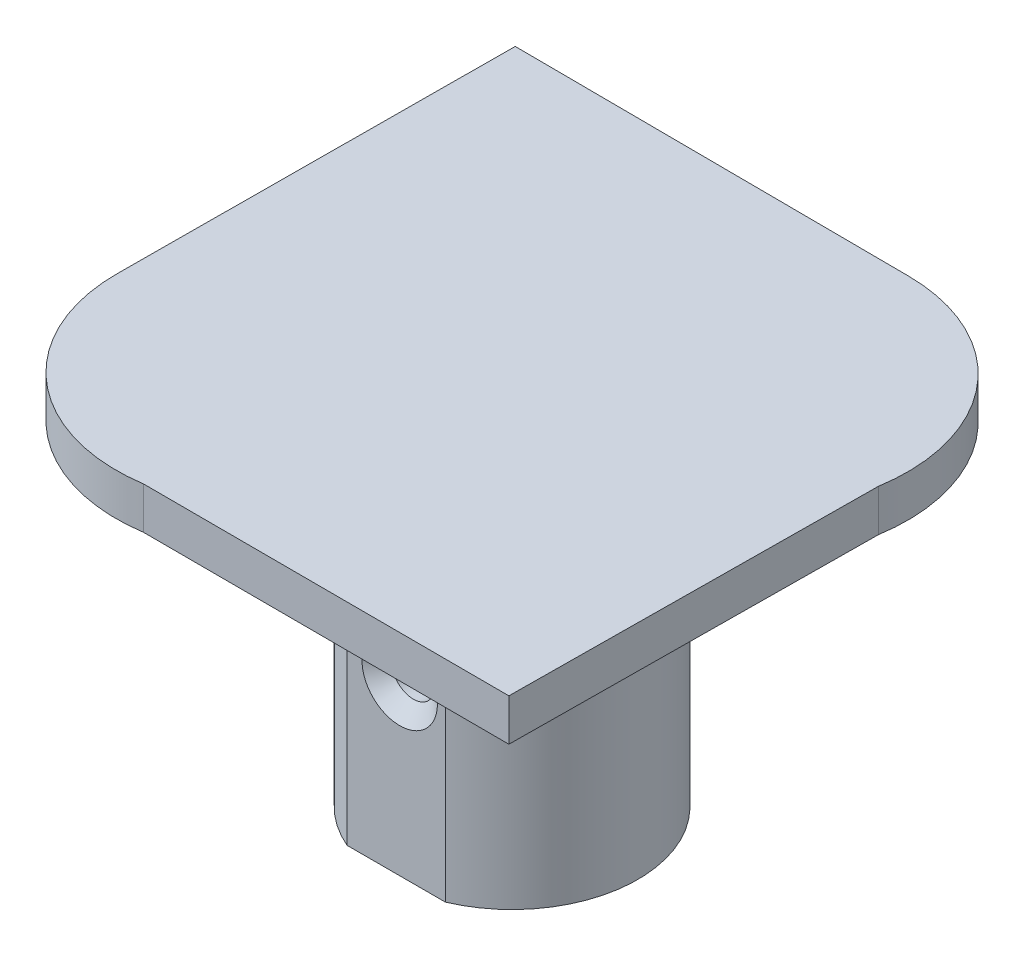
ISO-10303-21;
HEADER;
FILE_DESCRIPTION(('STEP AP214'),'2;1');
FILE_NAME('part.step','',(''),(''),'','','');
FILE_SCHEMA(('AUTOMOTIVE_DESIGN { 1 0 10303 214 1 1 1 1 }'));
ENDSEC;
DATA;
#1=APPLICATION_CONTEXT('core data for automotive mechanical design processes');
#2=APPLICATION_PROTOCOL_DEFINITION('international standard','automotive_design',2000,#1);
#3=PRODUCT_CONTEXT('',#1,'mechanical');
#4=PRODUCT('Part','Part','',(#3));
#5=PRODUCT_RELATED_PRODUCT_CATEGORY('part','',(#4));
#6=PRODUCT_DEFINITION_FORMATION('','',#4);
#7=PRODUCT_DEFINITION_CONTEXT('part definition',#1,'design');
#8=PRODUCT_DEFINITION('design','',#6,#7);
#9=PRODUCT_DEFINITION_SHAPE('','',#8);
#10=(LENGTH_UNIT() NAMED_UNIT(*) SI_UNIT(.MILLI.,.METRE.));
#11=(NAMED_UNIT(*) PLANE_ANGLE_UNIT() SI_UNIT($,.RADIAN.));
#12=(NAMED_UNIT(*) SI_UNIT($,.STERADIAN.) SOLID_ANGLE_UNIT());
#13=UNCERTAINTY_MEASURE_WITH_UNIT(LENGTH_MEASURE(1.E-05),#10,'distance_accuracy_value','');
#14=(GEOMETRIC_REPRESENTATION_CONTEXT(3) GLOBAL_UNCERTAINTY_ASSIGNED_CONTEXT((#13)) GLOBAL_UNIT_ASSIGNED_CONTEXT((#10,
#11,#12)) REPRESENTATION_CONTEXT('',''));
#15=CARTESIAN_POINT('',(0.,0.,0.));
#16=DIRECTION('',(0.,0.,1.));
#17=DIRECTION('',(1.,0.,0.));
#18=AXIS2_PLACEMENT_3D('',#15,#16,#17);
#19=CARTESIAN_POINT('',(-14.787057316952,3.175,-0.0839624008313394));
#20=DIRECTION('',(-0.999983879975885,0.,-0.00567800919112956));
#21=DIRECTION('',(-0.00567800919112956,0.,0.999983879975885));
#22=AXIS2_PLACEMENT_3D('',#19,#20,#21);
#23=PLANE('',#22);
#24=DIRECTION('',(0.00567800919112956,0.,-0.999983879975885));
#25=VECTOR('',#24,1.);
#26=CARTESIAN_POINT('',(-14.787057316952,0.,-0.0839624008313394));
#27=LINE('',#26,#25);
#28=CARTESIAN_POINT('',(-14.7878214169935,0.,0.0506072517345835));
#29=VERTEX_POINT('',#28);
#30=CARTESIAN_POINT('',(-14.6178057651198,0.,-29.8917379425649));
#31=VERTEX_POINT('',#30);
#32=EDGE_CURVE('E235',#29,#31,#27,.T.);
#33=ORIENTED_EDGE('',*,*,#32,.F.);
#34=DIRECTION('',(0.,-1.,0.));
#35=VECTOR('',#34,1.);
#36=CARTESIAN_POINT('',(-14.7878214169935,3.175,0.0506072517345835));
#37=LINE('',#36,#35);
#38=CARTESIAN_POINT('',(-14.7878214169935,3.175,0.0506072517345835));
#39=VERTEX_POINT('',#38);
#40=EDGE_CURVE('E241',#39,#29,#37,.T.);
#41=ORIENTED_EDGE('',*,*,#40,.F.);
#42=DIRECTION('',(0.00567800919112956,0.,-0.999983879975885));
#43=VECTOR('',#42,1.);
#44=CARTESIAN_POINT('',(-14.787057316952,3.175,-0.0839624008313394));
#45=LINE('',#44,#43);
#46=CARTESIAN_POINT('',(-14.6178057651198,3.175,-29.8917379425649));
#47=VERTEX_POINT('',#46);
#48=EDGE_CURVE('E218',#39,#47,#45,.T.);
#49=ORIENTED_EDGE('',*,*,#48,.T.);
#50=DIRECTION('',(0.,-1.,0.));
#51=VECTOR('',#50,1.);
#52=CARTESIAN_POINT('',(-14.6178057651198,3.175,-29.8917379425649));
#53=LINE('',#52,#51);
#54=EDGE_CURVE('E243',#47,#31,#53,.T.);
#55=ORIENTED_EDGE('',*,*,#54,.T.);
#56=EDGE_LOOP('',(#33,#41,#49,#55));
#57=FACE_BOUND('',#56,.T.);
#58=ADVANCED_FACE('F73',(#57),#23,.T.);
#59=CARTESIAN_POINT('',(0.,0.,0.));
#60=DIRECTION('',(0.,1.,0.));
#61=DIRECTION('',(0.,0.,1.));
#62=AXIS2_PLACEMENT_3D('',#59,#60,#61);
#63=PLANE('',#62);
#64=CARTESIAN_POINT('',(6.55275451155434,0.,-8.47938761040723));
#65=DIRECTION('',(0.,1.,0.));
#66=DIRECTION('',(0.,0.,1.));
#67=AXIS2_PLACEMENT_3D('',#64,#65,#66);
#68=CIRCLE('',#67,14.525);
#69=CARTESIAN_POINT('',(-5.02592046515915,0.,-17.2492171859251));
#70=VERTEX_POINT('',#69);
#71=CARTESIAN_POINT('',(-5.02592046515915,0.,0.290441965110683));
#72=VERTEX_POINT('',#71);
#73=EDGE_CURVE('E257',#70,#72,#68,.T.);
#74=ORIENTED_EDGE('',*,*,#73,.T.);
#75=DIRECTION('',(1.,0.,0.));
#76=VECTOR('',#75,1.);
#77=CARTESIAN_POINT('',(2.83580492669698,0.,0.290441965110683));
#78=LINE('',#77,#76);
#79=CARTESIAN_POINT('',(18.1314294882678,0.,0.290441965110683));
#80=VERTEX_POINT('',#79);
#81=EDGE_CURVE('E193',#72,#80,#78,.T.);
#82=ORIENTED_EDGE('',*,*,#81,.T.);
#83=CARTESIAN_POINT('',(6.55275451155434,0.,-8.47938761040723));
#84=DIRECTION('',(0.,1.,0.));
#85=DIRECTION('',(0.,0.,1.));
#86=AXIS2_PLACEMENT_3D('',#83,#84,#85);
#87=CIRCLE('',#86,14.525);
#88=CARTESIAN_POINT('',(18.1314294882678,0.,-17.2492171859251));
#89=VERTEX_POINT('',#88);
#90=EDGE_CURVE('E254',#80,#89,#87,.T.);
#91=ORIENTED_EDGE('',*,*,#90,.T.);
#92=DIRECTION('',(-1.,0.,0.));
#93=VECTOR('',#92,1.);
#94=CARTESIAN_POINT('',(2.83580492669698,0.,-17.2492171859251));
#95=LINE('',#94,#93);
#96=EDGE_CURVE('E191',#89,#70,#95,.T.);
#97=ORIENTED_EDGE('',*,*,#96,.T.);
#98=EDGE_LOOP('',(#74,#82,#91,#97));
#99=FACE_BOUND('',#98,.T.);
#100=DIRECTION('',(0.999997371152212,0.,0.0022929650381687));
#101=VECTOR('',#100,1.);
#102=CARTESIAN_POINT('',(-0.0295089928449218,0.,12.8693262998196));
#103=LINE('',#102,#101);
#104=CARTESIAN_POINT('',(1.55691431968918E-13,0.,12.8693939630863));
#105=VERTEX_POINT('',#104);
#106=CARTESIAN_POINT('',(27.7233147882286,0.,12.9329627217505));
#107=VERTEX_POINT('',#106);
#108=EDGE_CURVE('E203',#105,#107,#103,.T.);
#109=ORIENTED_EDGE('',*,*,#108,.F.);
#110=CARTESIAN_POINT('',(-1.91876519569873,0.,0.143843244123492));
#111=DIRECTION('',(0.,1.,0.));
#112=DIRECTION('',(0.,0.,1.));
#113=AXIS2_PLACEMENT_3D('',#110,#111,#112);
#114=CIRCLE('',#113,12.8693939630863);
#115=EDGE_CURVE('E210',#29,#105,#114,.T.);
#116=ORIENTED_EDGE('',*,*,#115,.F.);
#117=ORIENTED_EDGE('',*,*,#32,.T.);
#118=DIRECTION('',(-0.999983879975885,0.,-0.00567800919112986));
#119=VECTOR('',#118,1.);
#120=CARTESIAN_POINT('',(0.169251551832196,0.,-29.8077755417336));
#121=LINE('',#120,#119);
#122=CARTESIAN_POINT('',(15.3245394291797,0.,-29.7217222906913));
#123=VERTEX_POINT('',#122);
#124=EDGE_CURVE('E232',#123,#31,#121,.T.);
#125=ORIENTED_EDGE('',*,*,#124,.F.);
#126=CARTESIAN_POINT('',(15.2716305265402,0.,-16.8524370881192));
#127=DIRECTION('',(0.,1.,0.));
#128=DIRECTION('',(0.,0.,1.));
#129=AXIS2_PLACEMENT_3D('',#126,#127,#128);
#130=CIRCLE('',#129,12.8693939630863);
#131=CARTESIAN_POINT('',(27.974571525793,0.,-14.7892863552293));
#132=VERTEX_POINT('',#131);
#133=EDGE_CURVE('E229',#123,#132,#130,.F.);
#134=ORIENTED_EDGE('',*,*,#133,.T.);
#135=DIRECTION('',(-0.00906298828145228,0.,0.999958930278344));
#136=VECTOR('',#135,1.);
#137=CARTESIAN_POINT('',(27.8382441331033,0.,0.252308042575603));
#138=LINE('',#137,#136);
#139=EDGE_CURVE('E226',#132,#107,#138,.T.);
#140=ORIENTED_EDGE('',*,*,#139,.T.);
#141=EDGE_LOOP('',(#109,#116,#117,#125,#134,#140));
#142=FACE_BOUND('',#141,.T.);
#143=ADVANCED_FACE('F290',(#99,#142),#63,.F.);
#144=CARTESIAN_POINT('',(0.169251551832196,3.175,-29.8077755417336));
#145=DIRECTION('',(-0.00567800919112985,0.,0.999983879975885));
#146=DIRECTION('',(0.999983879975885,0.,0.00567800919112985));
#147=AXIS2_PLACEMENT_3D('',#144,#145,#146);
#148=PLANE('',#147);
#149=ORIENTED_EDGE('',*,*,#124,.T.);
#150=ORIENTED_EDGE('',*,*,#54,.F.);
#151=DIRECTION('',(-0.999983879975885,0.,-0.00567800919112986));
#152=VECTOR('',#151,1.);
#153=CARTESIAN_POINT('',(0.169251551832196,3.175,-29.8077755417336));
#154=LINE('',#153,#152);
#155=CARTESIAN_POINT('',(15.3245394291797,3.175,-29.7217222906913));
#156=VERTEX_POINT('',#155);
#157=EDGE_CURVE('E216',#156,#47,#154,.T.);
#158=ORIENTED_EDGE('',*,*,#157,.F.);
#159=DIRECTION('',(0.,-1.,0.));
#160=VECTOR('',#159,1.);
#161=CARTESIAN_POINT('',(15.3245394291797,3.175,-29.7217222906913));
#162=LINE('',#161,#160);
#163=EDGE_CURVE('E245',#156,#123,#162,.T.);
#164=ORIENTED_EDGE('',*,*,#163,.T.);
#165=EDGE_LOOP('',(#149,#150,#158,#164));
#166=FACE_BOUND('',#165,.T.);
#167=ADVANCED_FACE('F293',(#166),#148,.F.);
#168=CARTESIAN_POINT('',(15.2716305265402,3.175,-16.8524370881192));
#169=DIRECTION('',(0.,-1.,0.));
#170=DIRECTION('',(0.,0.,-1.));
#171=AXIS2_PLACEMENT_3D('',#168,#169,#170);
#172=CYLINDRICAL_SURFACE('',#171,12.8693939630863);
#173=ORIENTED_EDGE('',*,*,#133,.F.);
#174=ORIENTED_EDGE('',*,*,#163,.F.);
#175=CARTESIAN_POINT('',(15.2716305265402,3.175,-16.8524370881192));
#176=DIRECTION('',(0.,1.,0.));
#177=DIRECTION('',(0.,0.,1.));
#178=AXIS2_PLACEMENT_3D('',#175,#176,#177);
#179=CIRCLE('',#178,12.8693939630863);
#180=CARTESIAN_POINT('',(27.974571525793,3.175,-14.7892863552293));
#181=VERTEX_POINT('',#180);
#182=EDGE_CURVE('E213',#156,#181,#179,.F.);
#183=ORIENTED_EDGE('',*,*,#182,.T.);
#184=DIRECTION('',(0.,-1.,0.));
#185=VECTOR('',#184,1.);
#186=CARTESIAN_POINT('',(27.974571525793,3.175,-14.7892863552293));
#187=LINE('',#186,#185);
#188=EDGE_CURVE('E247',#181,#132,#187,.T.);
#189=ORIENTED_EDGE('',*,*,#188,.T.);
#190=EDGE_LOOP('',(#173,#174,#183,#189));
#191=FACE_BOUND('',#190,.T.);
#192=ADVANCED_FACE('F305',(#191),#172,.T.);
#193=CARTESIAN_POINT('',(27.8382441331033,3.175,0.252308042575603));
#194=DIRECTION('',(0.999958930278344,0.,0.00906298828145228));
#195=DIRECTION('',(0.00906298828145228,0.,-0.999958930278344));
#196=AXIS2_PLACEMENT_3D('',#193,#194,#195);
#197=PLANE('',#196);
#198=ORIENTED_EDGE('',*,*,#139,.F.);
#199=ORIENTED_EDGE('',*,*,#188,.F.);
#200=DIRECTION('',(-0.00906298828145228,0.,0.999958930278344));
#201=VECTOR('',#200,1.);
#202=CARTESIAN_POINT('',(27.8382441331033,3.175,0.252308042575603));
#203=LINE('',#202,#201);
#204=CARTESIAN_POINT('',(27.7233147882286,3.175,12.9329627217505));
#205=VERTEX_POINT('',#204);
#206=EDGE_CURVE('E209',#181,#205,#203,.T.);
#207=ORIENTED_EDGE('',*,*,#206,.T.);
#208=DIRECTION('',(0.,-1.,0.));
#209=VECTOR('',#208,1.);
#210=CARTESIAN_POINT('',(27.7233147882286,3.175,12.9329627217505));
#211=LINE('',#210,#209);
#212=EDGE_CURVE('E249',#205,#107,#211,.T.);
#213=ORIENTED_EDGE('',*,*,#212,.T.);
#214=EDGE_LOOP('',(#198,#199,#207,#213));
#215=FACE_BOUND('',#214,.T.);
#216=ADVANCED_FACE('F309',(#215),#197,.T.);
#217=CARTESIAN_POINT('',(-0.0295089928449218,3.175,12.8693262998196));
#218=DIRECTION('',(0.0022929650381687,0.,-0.999997371152211));
#219=DIRECTION('',(-0.999997371152212,0.,-0.0022929650381687));
#220=AXIS2_PLACEMENT_3D('',#217,#218,#219);
#221=PLANE('',#220);
#222=ORIENTED_EDGE('',*,*,#108,.T.);
#223=ORIENTED_EDGE('',*,*,#212,.F.);
#224=DIRECTION('',(0.999997371152212,0.,0.0022929650381687));
#225=VECTOR('',#224,1.);
#226=CARTESIAN_POINT('',(-0.0295089928449218,3.175,12.8693262998196));
#227=LINE('',#226,#225);
#228=CARTESIAN_POINT('',(1.55691431968918E-13,3.175,12.8693939630863));
#229=VERTEX_POINT('',#228);
#230=EDGE_CURVE('E207',#229,#205,#227,.T.);
#231=ORIENTED_EDGE('',*,*,#230,.F.);
#232=DIRECTION('',(0.,-1.,0.));
#233=VECTOR('',#232,1.);
#234=CARTESIAN_POINT('',(1.55691431968918E-13,3.175,12.8693939630863));
#235=LINE('',#234,#233);
#236=EDGE_CURVE('E223',#229,#105,#235,.T.);
#237=ORIENTED_EDGE('',*,*,#236,.T.);
#238=EDGE_LOOP('',(#222,#223,#231,#237));
#239=FACE_BOUND('',#238,.T.);
#240=ADVANCED_FACE('F298',(#239),#221,.F.);
#241=CARTESIAN_POINT('',(-1.91876519569873,3.175,0.143843244123492));
#242=DIRECTION('',(0.,-1.,0.));
#243=DIRECTION('',(0.,0.,-1.));
#244=AXIS2_PLACEMENT_3D('',#241,#242,#243);
#245=CYLINDRICAL_SURFACE('',#244,12.8693939630863);
#246=ORIENTED_EDGE('',*,*,#115,.T.);
#247=ORIENTED_EDGE('',*,*,#236,.F.);
#248=CARTESIAN_POINT('',(-1.91876519569873,3.175,0.143843244123492));
#249=DIRECTION('',(0.,1.,0.));
#250=DIRECTION('',(0.,0.,1.));
#251=AXIS2_PLACEMENT_3D('',#248,#249,#250);
#252=CIRCLE('',#251,12.8693939630863);
#253=EDGE_CURVE('E221',#39,#229,#252,.T.);
#254=ORIENTED_EDGE('',*,*,#253,.F.);
#255=ORIENTED_EDGE('',*,*,#40,.T.);
#256=EDGE_LOOP('',(#246,#247,#254,#255));
#257=FACE_BOUND('',#256,.T.);
#258=ADVANCED_FACE('F288',(#257),#245,.T.);
#259=CARTESIAN_POINT('',(0.,3.175,0.));
#260=DIRECTION('',(0.,1.,0.));
#261=DIRECTION('',(0.,0.,1.));
#262=AXIS2_PLACEMENT_3D('',#259,#260,#261);
#263=PLANE('',#262);
#264=ORIENTED_EDGE('',*,*,#230,.T.);
#265=ORIENTED_EDGE('',*,*,#206,.F.);
#266=ORIENTED_EDGE('',*,*,#182,.F.);
#267=ORIENTED_EDGE('',*,*,#157,.T.);
#268=ORIENTED_EDGE('',*,*,#48,.F.);
#269=ORIENTED_EDGE('',*,*,#253,.T.);
#270=EDGE_LOOP('',(#264,#265,#266,#267,#268,#269));
#271=FACE_BOUND('',#270,.T.);
#272=ADVANCED_FACE('F285',(#271),#263,.T.);
#273=CARTESIAN_POINT('',(6.55275451155434,-25.4,-8.47938761040723));
#274=DIRECTION('',(0.,1.,0.));
#275=DIRECTION('',(0.,0.,1.));
#276=AXIS2_PLACEMENT_3D('',#273,#274,#275);
#277=CYLINDRICAL_SURFACE('',#276,9.525);
#278=DIRECTION('',(0.,1.,0.));
#279=VECTOR('',#278,1.);
#280=CARTESIAN_POINT('',(2.83580492669698,-25.4,0.290441965110683));
#281=LINE('',#280,#279);
#282=CARTESIAN_POINT('',(2.83580492669698,-25.4,0.290441965110683));
#283=VERTEX_POINT('',#282);
#284=CARTESIAN_POINT('',(2.83580492669698,-5.,0.290441965110683));
#285=VERTEX_POINT('',#284);
#286=EDGE_CURVE('E166',#283,#285,#281,.T.);
#287=ORIENTED_EDGE('',*,*,#286,.T.);
#288=CARTESIAN_POINT('',(6.55275451155434,-5.,-8.47938761040723));
#289=DIRECTION('',(0.,1.,0.));
#290=DIRECTION('',(0.,0.,1.));
#291=AXIS2_PLACEMENT_3D('',#288,#289,#290);
#292=CIRCLE('',#291,9.525);
#293=CARTESIAN_POINT('',(2.83580492669698,-5.,-17.2492171859251));
#294=VERTEX_POINT('',#293);
#295=EDGE_CURVE('E260',#285,#294,#292,.F.);
#296=ORIENTED_EDGE('',*,*,#295,.T.);
#297=DIRECTION('',(0.,1.,0.));
#298=VECTOR('',#297,1.);
#299=CARTESIAN_POINT('',(2.83580492669698,-25.4,-17.2492171859251));
#300=LINE('',#299,#298);
#301=CARTESIAN_POINT('',(2.83580492669698,-25.4,-17.2492171859251));
#302=VERTEX_POINT('',#301);
#303=EDGE_CURVE('E190',#302,#294,#300,.T.);
#304=ORIENTED_EDGE('',*,*,#303,.F.);
#305=CARTESIAN_POINT('',(6.55275451155434,-25.4,-8.47938761040723));
#306=DIRECTION('',(0.,1.,0.));
#307=DIRECTION('',(0.,0.,1.));
#308=AXIS2_PLACEMENT_3D('',#305,#306,#307);
#309=CIRCLE('',#308,9.525);
#310=EDGE_CURVE('E183',#302,#283,#309,.T.);
#311=ORIENTED_EDGE('',*,*,#310,.T.);
#312=EDGE_LOOP('',(#287,#296,#304,#311));
#313=FACE_BOUND('',#312,.T.);
#314=ADVANCED_FACE('F188',(#313),#277,.T.);
#315=CARTESIAN_POINT('',(2.83580492669698,-25.4,-17.2492171859251));
#316=DIRECTION('',(0.,0.,-1.));
#317=DIRECTION('',(-1.,0.,0.));
#318=AXIS2_PLACEMENT_3D('',#315,#316,#317);
#319=PLANE('',#318);
#320=ORIENTED_EDGE('',*,*,#96,.F.);
#321=CARTESIAN_POINT('',(18.1314294882678,0.,-17.2492171859251));
#322=CARTESIAN_POINT('',(17.9194691926212,-1.08010335164074E-05,-17.2492171859251));
#323=CARTESIAN_POINT('',(17.7076646851101,-0.00856427086780167,-17.2492171859251));
#324=CARTESIAN_POINT('',(17.2854870599636,-0.041729824746225,-17.2492171859251));
#325=CARTESIAN_POINT('',(17.0751128730227,-0.0663281678904239,-17.2492171859251));
#326=CARTESIAN_POINT('',(16.4487753805645,-0.162445019380643,-17.2492171859251));
#327=CARTESIAN_POINT('',(16.0360587919172,-0.256300466560732,-17.2492171859251));
#328=CARTESIAN_POINT('',(15.3953364668106,-0.445870901359424,-17.2492171859251));
#329=CARTESIAN_POINT('',(15.1619967507449,-0.524528457185258,-17.2492171859251));
#330=CARTESIAN_POINT('',(14.7014847114515,-0.698203532807642,-17.2492171859251));
#331=CARTESIAN_POINT('',(14.4743111865138,-0.793217837998378,-17.2492171859251));
#332=CARTESIAN_POINT('',(14.0266364385629,-0.998718780997651,-17.2492171859251));
#333=CARTESIAN_POINT('',(13.8061473842654,-1.10923179134389,-17.2492171859251));
#334=CARTESIAN_POINT('',(13.3731625151585,-1.34487158663403,-17.2492171859251));
#335=CARTESIAN_POINT('',(13.1606648550108,-1.46999497007793,-17.2492171859251));
#336=CARTESIAN_POINT('',(12.8102233220454,-1.69303100460494,-17.2492171859251));
#337=CARTESIAN_POINT('',(12.6698410781402,-1.78713363775158,-17.2492171859251));
#338=CARTESIAN_POINT('',(12.3939547995107,-1.9822289869433,-17.2492171859251));
#339=CARTESIAN_POINT('',(12.2584501303572,-2.08322080192479,-17.2492171859251));
#340=CARTESIAN_POINT('',(11.9932620102002,-2.29231554978037,-17.2492171859251));
#341=CARTESIAN_POINT('',(11.8635725657559,-2.40041086421365,-17.2492171859251));
#342=CARTESIAN_POINT('',(11.6111248586294,-2.62440060019461,-17.2492171859251));
#343=CARTESIAN_POINT('',(11.4883640428069,-2.74029211394592,-17.2492171859251));
#344=CARTESIAN_POINT('',(11.2997524633104,-2.93212125346451,-17.2492171859251));
#345=CARTESIAN_POINT('',(11.231003184476,-3.00521308215662,-17.2492171859251));
#346=CARTESIAN_POINT('',(11.097328997464,-3.15480287485262,-17.2492171859251));
#347=CARTESIAN_POINT('',(11.0324031910437,-3.23130003137279,-17.2492171859251));
#348=CARTESIAN_POINT('',(10.9072360263084,-3.3880415076945,-17.2492171859251));
#349=CARTESIAN_POINT('',(10.8469938239118,-3.46828514811108,-17.2492171859251));
#350=CARTESIAN_POINT('',(10.7324131067761,-3.63285271555483,-17.2492171859251));
#351=CARTESIAN_POINT('',(10.6780720798972,-3.71717488407441,-17.2492171859251));
#352=CARTESIAN_POINT('',(10.5594784262292,-3.9199510979995,-17.2492171859251));
#353=CARTESIAN_POINT('',(10.4982120601026,-4.04019821891992,-17.2492171859251));
#354=CARTESIAN_POINT('',(10.3946399863679,-4.28830832952067,-17.2492171859251));
#355=CARTESIAN_POINT('',(10.35224954079,-4.41613430281332,-17.2492171859251));
#356=CARTESIAN_POINT('',(10.3050692840302,-4.62083288879181,-17.2492171859251));
#357=CARTESIAN_POINT('',(10.2919461376699,-4.69580215913049,-17.2492171859251));
#358=CARTESIAN_POINT('',(10.2742007251051,-4.84714763042659,-17.2492171859251));
#359=CARTESIAN_POINT('',(10.2696255834887,-4.9235292998474,-17.2492171859251));
#360=CARTESIAN_POINT('',(10.2697040964117,-5.,-17.2492171859251));
#361=B_SPLINE_CURVE_WITH_KNOTS('',3,(#321,#322,#323,#324,#325,#326,#327,#328,#329,#330,#331,
#332,#333,#334,#335,#336,#337,#338,#339,#340,#341,#342,#343,#344,#345,#346,#347,#348,#349,#350,
#351,#352,#353,#354,#355,#356,#357,#358,#359,#360),.UNSPECIFIED.,.F.,.F.,(4,2,2,2,2,2,2,2,2,2,2,
2,2,2,2,2,2,2,2,4),(0.,0.635441986520581,1.27034049097434,2.53556589946514,3.27379935616496,
4.01188789250627,4.75124794974994,5.4904362155116,5.9972674150916,6.50403245083158,
7.01026258619062,7.51630494555262,7.81723118234221,8.11808643859802,8.4188873482623,
8.7195597003361,9.12328321344754,9.52517559033125,9.75304733308348,9.98217165273955),.UNSPECIFIED.);
#362=CARTESIAN_POINT('',(10.2697040964117,-5.,-17.2492171859251));
#363=VERTEX_POINT('',#362);
#364=EDGE_CURVE('E86',#89,#363,#361,.T.);
#365=ORIENTED_EDGE('',*,*,#364,.T.);
#366=DIRECTION('',(0.,1.,0.));
#367=VECTOR('',#366,1.);
#368=CARTESIAN_POINT('',(10.2697040964117,-25.4,-17.2492171859251));
#369=LINE('',#368,#367);
#370=CARTESIAN_POINT('',(10.2697040964117,-25.4,-17.2492171859251));
#371=VERTEX_POINT('',#370);
#372=EDGE_CURVE('E204',#371,#363,#369,.T.);
#373=ORIENTED_EDGE('',*,*,#372,.F.);
#374=DIRECTION('',(-1.,0.,0.));
#375=VECTOR('',#374,1.);
#376=CARTESIAN_POINT('',(2.83580492669698,-25.4,-17.2492171859251));
#377=LINE('',#376,#375);
#378=EDGE_CURVE('E176',#371,#302,#377,.T.);
#379=ORIENTED_EDGE('',*,*,#378,.T.);
#380=ORIENTED_EDGE('',*,*,#303,.T.);
#381=CARTESIAN_POINT('',(2.83580492669698,-5.,-17.2492171859251));
#382=CARTESIAN_POINT('',(2.83585735576436,-4.93392606903913,-17.2492171859251));
#383=CARTESIAN_POINT('',(2.83245032083564,-4.86788564527168,-17.2492171859251));
#384=CARTESIAN_POINT('',(2.81913134793781,-4.73660227821059,-17.2492171859251));
#385=CARTESIAN_POINT('',(2.8092334432557,-4.67135792308722,-17.2492171859251));
#386=CARTESIAN_POINT('',(2.78356821542695,-4.54322911716705,-17.2492171859251));
#387=CARTESIAN_POINT('',(2.76790575808162,-4.48032336125234,-17.2492171859251));
#388=CARTESIAN_POINT('',(2.73130893703406,-4.35604346778452,-17.2492171859251));
#389=CARTESIAN_POINT('',(2.71037144476756,-4.29467026299651,-17.2492171859251));
#390=CARTESIAN_POINT('',(2.65479467982944,-4.15003507434894,-17.2492171859251));
#391=CARTESIAN_POINT('',(2.617999367149,-4.06760139147074,-17.2492171859251));
#392=CARTESIAN_POINT('',(2.53720087991344,-3.90637274043713,-17.2492171859251));
#393=CARTESIAN_POINT('',(2.49319453293862,-3.82757939345666,-17.2492171859251));
#394=CARTESIAN_POINT('',(2.35181916149835,-3.59522707449915,-17.2492171859251));
#395=CARTESIAN_POINT('',(2.2456525106266,-3.44702465464945,-17.2492171859251));
#396=CARTESIAN_POINT('',(2.01710155195178,-3.16153147017104,-17.2492171859251));
#397=CARTESIAN_POINT('',(1.89455529295157,-3.02437501136576,-17.2492171859251));
#398=CARTESIAN_POINT('',(1.63852344896691,-2.76051242668999,-17.2492171859251));
#399=CARTESIAN_POINT('',(1.50502711043946,-2.63381682490145,-17.2492171859251));
#400=CARTESIAN_POINT('',(1.22974396394599,-2.38961989272793,-17.2492171859251));
#401=CARTESIAN_POINT('',(1.08795036212425,-2.27212628638394,-17.2492171859251));
#402=CARTESIAN_POINT('',(0.797705494189252,-2.04563905876305,-17.2492171859251));
#403=CARTESIAN_POINT('',(0.6492523561963,-1.93664785124161,-17.2492171859251));
#404=CARTESIAN_POINT('',(0.25008684541382,-1.65975014992138,-17.2492171859251));
#405=CARTESIAN_POINT('',(-0.00538932139224432,-1.49866647788721,-17.2492171859251));
#406=CARTESIAN_POINT('',(-0.528882259512914,-1.19809979734365,-17.2492171859251));
#407=CARTESIAN_POINT('',(-0.796906404028565,-1.05862970179418,-17.2492171859251));
#408=CARTESIAN_POINT('',(-1.34280694330271,-0.802966789464882,-17.2492171859251));
#409=CARTESIAN_POINT('',(-1.62064782039231,-0.68669851019944,-17.2492171859251));
#410=CARTESIAN_POINT('',(-2.18538388608861,-0.478812048668486,-17.2492171859251));
#411=CARTESIAN_POINT('',(-2.47227901279098,-0.387193697911004,-17.2492171859251));
#412=CARTESIAN_POINT('',(-3.13110793879558,-0.210216071877411,-17.2492171859251));
#413=CARTESIAN_POINT('',(-3.50532687956212,-0.133033183552169,-17.2492171859251));
#414=CARTESIAN_POINT('',(-4.07209368802669,-0.0541996507107554,-17.2492171859251));
#415=CARTESIAN_POINT('',(-4.26219398436106,-0.0340764258352815,-17.2492171859251));
#416=CARTESIAN_POINT('',(-4.64346755189145,-0.00697476595332527,-17.2492171859251));
#417=CARTESIAN_POINT('',(-4.83464153305554,-6.40512164917123E-06,-17.2492171859251));
#418=CARTESIAN_POINT('',(-5.02592046515915,0.,-17.2492171859251));
#419=B_SPLINE_CURVE_WITH_KNOTS('',3,(#381,#382,#383,#384,#385,#386,#387,#388,#389,#390,#391,
#392,#393,#394,#395,#396,#397,#398,#399,#400,#401,#402,#403,#404,#405,#406,#407,#408,#409,#410,
#411,#412,#413,#414,#415,#416,#417,#418),.UNSPECIFIED.,.F.,.F.,(4,2,2,2,2,2,2,2,2,2,2,2,2,2,2,2,
2,2,4),(0.,0.198080500692129,0.395734156177857,0.589956869673195,0.784295046779391,
1.05464934232501,1.32512289834904,1.87034535451716,2.42142426780051,2.9730510016003,
3.52513590907591,4.07737698244848,4.98226836216139,5.88769829913287,6.79013358219683,
7.69256269660348,8.83551213323343,9.40860365544851,9.98213388123111),.UNSPECIFIED.);
#420=EDGE_CURVE('E267',#294,#70,#419,.T.);
#421=ORIENTED_EDGE('',*,*,#420,.T.);
#422=EDGE_LOOP('',(#320,#365,#373,#379,#380,#421));
#423=FACE_BOUND('',#422,.T.);
#424=ADVANCED_FACE('F284',(#423),#319,.T.);
#425=CARTESIAN_POINT('',(6.55275451155434,-25.4,-8.47938761040723));
#426=DIRECTION('',(0.,1.,0.));
#427=DIRECTION('',(0.,0.,1.));
#428=AXIS2_PLACEMENT_3D('',#425,#426,#427);
#429=CYLINDRICAL_SURFACE('',#428,9.525);
#430=ORIENTED_EDGE('',*,*,#372,.T.);
#431=CARTESIAN_POINT('',(6.55275451155434,-5.,-8.47938761040723));
#432=DIRECTION('',(0.,1.,0.));
#433=DIRECTION('',(0.,0.,1.));
#434=AXIS2_PLACEMENT_3D('',#431,#432,#433);
#435=CIRCLE('',#434,9.525);
#436=CARTESIAN_POINT('',(10.2697040964117,-5.,0.290441965110683));
#437=VERTEX_POINT('',#436);
#438=EDGE_CURVE('E99',#363,#437,#435,.F.);
#439=ORIENTED_EDGE('',*,*,#438,.T.);
#440=DIRECTION('',(0.,1.,0.));
#441=VECTOR('',#440,1.);
#442=CARTESIAN_POINT('',(10.2697040964117,-25.4,0.290441965110683));
#443=LINE('',#442,#441);
#444=CARTESIAN_POINT('',(10.2697040964117,-25.4,0.290441965110683));
#445=VERTEX_POINT('',#444);
#446=EDGE_CURVE('E175',#445,#437,#443,.T.);
#447=ORIENTED_EDGE('',*,*,#446,.F.);
#448=CARTESIAN_POINT('',(6.55275451155434,-25.4,-8.47938761040723));
#449=DIRECTION('',(0.,1.,0.));
#450=DIRECTION('',(0.,0.,1.));
#451=AXIS2_PLACEMENT_3D('',#448,#449,#450);
#452=CIRCLE('',#451,9.525);
#453=EDGE_CURVE('E186',#445,#371,#452,.T.);
#454=ORIENTED_EDGE('',*,*,#453,.T.);
#455=EDGE_LOOP('',(#430,#439,#447,#454));
#456=FACE_BOUND('',#455,.T.);
#457=ADVANCED_FACE('F279',(#456),#429,.T.);
#458=CARTESIAN_POINT('',(2.83580492669698,-25.4,0.290441965110683));
#459=DIRECTION('',(0.,0.,1.));
#460=DIRECTION('',(1.,0.,0.));
#461=AXIS2_PLACEMENT_3D('',#458,#459,#460);
#462=PLANE('',#461);
#463=CARTESIAN_POINT('',(6.81485322038,-12.7,0.290441965110685));
#464=DIRECTION('',(0.,0.,1.));
#465=DIRECTION('',(1.,0.,0.));
#466=AXIS2_PLACEMENT_3D('',#463,#464,#465);
#467=CIRCLE('',#466,2.8575);
#468=CARTESIAN_POINT('',(9.67235322038,-12.7,0.290441965110685));
#469=VERTEX_POINT('',#468);
#470=EDGE_CURVE('E516',#469,#469,#467,.T.);
#471=ORIENTED_EDGE('',*,*,#470,.F.);
#472=EDGE_LOOP('',(#471));
#473=FACE_BOUND('',#472,.T.);
#474=ORIENTED_EDGE('',*,*,#81,.F.);
#475=CARTESIAN_POINT('',(-5.02592046515915,0.,0.290441965110683));
#476=CARTESIAN_POINT('',(-4.81396016951247,-1.08010335158606E-05,0.290441965110683));
#477=CARTESIAN_POINT('',(-4.60215566200145,-0.00856427086780111,0.290441965110683));
#478=CARTESIAN_POINT('',(-4.17997803685492,-0.0417298247462247,0.290441965110683));
#479=CARTESIAN_POINT('',(-3.96960384991401,-0.0663281678904239,0.290441965110683));
#480=CARTESIAN_POINT('',(-3.34326635745577,-0.162445019380643,0.290441965110683));
#481=CARTESIAN_POINT('',(-2.93054976880851,-0.256300466560733,0.290441965110683));
#482=CARTESIAN_POINT('',(-2.28982744370187,-0.445870901359424,0.290441965110683));
#483=CARTESIAN_POINT('',(-2.05648772763618,-0.524528457185257,0.290441965110683));
#484=CARTESIAN_POINT('',(-1.5959756883428,-0.698203532807642,0.290441965110683));
#485=CARTESIAN_POINT('',(-1.36880216340511,-0.793217837998378,0.290441965110683));
#486=CARTESIAN_POINT('',(-0.921127415454195,-0.998718780997652,0.290441965110683));
#487=CARTESIAN_POINT('',(-0.70063836115669,-1.10923179134389,0.290441965110683));
#488=CARTESIAN_POINT('',(-0.267653492049767,-1.34487158663403,0.290441965110683));
#489=CARTESIAN_POINT('',(-0.055155831902075,-1.46999497007793,0.290441965110683));
#490=CARTESIAN_POINT('',(0.295285701063256,-1.69303100460494,0.290441965110683));
#491=CARTESIAN_POINT('',(0.435667944968496,-1.78713363775158,0.290441965110683));
#492=CARTESIAN_POINT('',(0.711554223597984,-1.9822289869433,0.290441965110683));
#493=CARTESIAN_POINT('',(0.847058892751463,-2.0832208019248,0.290441965110683));
#494=CARTESIAN_POINT('',(1.11224701290852,-2.29231554978037,0.290441965110683));
#495=CARTESIAN_POINT('',(1.24193645735276,-2.40041086421365,0.290441965110683));
#496=CARTESIAN_POINT('',(1.49438416447934,-2.62440060019461,0.290441965110683));
#497=CARTESIAN_POINT('',(1.61714498030179,-2.74029211394593,0.290441965110683));
#498=CARTESIAN_POINT('',(1.80575655979827,-2.93212125346452,0.290441965110683));
#499=CARTESIAN_POINT('',(1.87450583863274,-3.00521308215663,0.290441965110683));
#500=CARTESIAN_POINT('',(2.0081800256447,-3.15480287485263,0.290441965110683));
#501=CARTESIAN_POINT('',(2.07310583206503,-3.23130003137279,0.290441965110683));
#502=CARTESIAN_POINT('',(2.19827299680029,-3.3880415076945,0.290441965110683));
#503=CARTESIAN_POINT('',(2.25851519919686,-3.46828514811108,0.290441965110683));
#504=CARTESIAN_POINT('',(2.37309591633256,-3.63285271555483,0.290441965110683));
#505=CARTESIAN_POINT('',(2.42743694321151,-3.7171748840744,0.290441965110683));
#506=CARTESIAN_POINT('',(2.54603059687947,-3.91995109799949,0.290441965110683));
#507=CARTESIAN_POINT('',(2.60729696300609,-4.04019821891992,0.290441965110683));
#508=CARTESIAN_POINT('',(2.71086903674077,-4.28830832952066,0.290441965110683));
#509=CARTESIAN_POINT('',(2.75325948231871,-4.41613430281332,0.290441965110683));
#510=CARTESIAN_POINT('',(2.80043973907846,-4.62083288879181,0.290441965110683));
#511=CARTESIAN_POINT('',(2.8135628854388,-4.69580215913048,0.290441965110683));
#512=CARTESIAN_POINT('',(2.83130829800359,-4.84714763042659,0.290441965110683));
#513=CARTESIAN_POINT('',(2.83588343962001,-4.9235292998474,0.290441965110683));
#514=CARTESIAN_POINT('',(2.83580492669699,-5.,0.290441965110683));
#515=B_SPLINE_CURVE_WITH_KNOTS('',3,(#475,#476,#477,#478,#479,#480,#481,#482,#483,#484,#485,
#486,#487,#488,#489,#490,#491,#492,#493,#494,#495,#496,#497,#498,#499,#500,#501,#502,#503,#504,
#505,#506,#507,#508,#509,#510,#511,#512,#513,#514),.UNSPECIFIED.,.F.,.F.,(4,2,2,2,2,2,2,2,2,2,2,
2,2,2,2,2,2,2,2,4),(0.,0.63544198652058,1.27034049097434,2.53556589946514,3.27379935616496,
4.01188789250628,4.75124794974995,5.4904362155116,5.99726741509161,6.50403245083159,
7.01026258619063,7.51630494555264,7.81723118234222,8.11808643859803,8.4188873482623,
8.7195597003361,9.12328321344754,9.52517559033125,9.75304733308348,9.98217165273955),.UNSPECIFIED.);
#516=EDGE_CURVE('E171',#72,#285,#515,.T.);
#517=ORIENTED_EDGE('',*,*,#516,.T.);
#518=ORIENTED_EDGE('',*,*,#286,.F.);
#519=DIRECTION('',(1.,0.,0.));
#520=VECTOR('',#519,1.);
#521=CARTESIAN_POINT('',(2.83580492669698,-25.4,0.290441965110683));
#522=LINE('',#521,#520);
#523=EDGE_CURVE('E169',#283,#445,#522,.T.);
#524=ORIENTED_EDGE('',*,*,#523,.T.);
#525=ORIENTED_EDGE('',*,*,#446,.T.);
#526=CARTESIAN_POINT('',(10.2697040964117,-5.,0.290441965110683));
#527=CARTESIAN_POINT('',(10.2696516673443,-4.93392606903913,0.290441965110683));
#528=CARTESIAN_POINT('',(10.2730587022731,-4.86788564527168,0.290441965110683));
#529=CARTESIAN_POINT('',(10.2863776751709,-4.73660227821059,0.290441965110683));
#530=CARTESIAN_POINT('',(10.296275579853,-4.67135792308722,0.290441965110683));
#531=CARTESIAN_POINT('',(10.3219408076817,-4.54322911716705,0.290441965110683));
#532=CARTESIAN_POINT('',(10.3376032650271,-4.48032336125234,0.290441965110683));
#533=CARTESIAN_POINT('',(10.3742000860746,-4.35604346778452,0.290441965110683));
#534=CARTESIAN_POINT('',(10.3951375783411,-4.29467026299651,0.290441965110683));
#535=CARTESIAN_POINT('',(10.4507143432792,-4.15003507434894,0.290441965110683));
#536=CARTESIAN_POINT('',(10.4875096559597,-4.06760139147074,0.290441965110683));
#537=CARTESIAN_POINT('',(10.5683081431952,-3.90637274043713,0.290441965110683));
#538=CARTESIAN_POINT('',(10.6123144901701,-3.82757939345666,0.290441965110683));
#539=CARTESIAN_POINT('',(10.7536898616103,-3.59522707449915,0.290441965110683));
#540=CARTESIAN_POINT('',(10.8598565124821,-3.44702465464945,0.290441965110683));
#541=CARTESIAN_POINT('',(11.0884074711569,-3.16153147017104,0.290441965110683));
#542=CARTESIAN_POINT('',(11.2109537301571,-3.02437501136576,0.290441965110683));
#543=CARTESIAN_POINT('',(11.4669855741418,-2.76051242669,0.290441965110683));
#544=CARTESIAN_POINT('',(11.6004819126692,-2.63381682490145,0.290441965110683));
#545=CARTESIAN_POINT('',(11.8757650591627,-2.38961989272793,0.290441965110683));
#546=CARTESIAN_POINT('',(12.0175586609844,-2.27212628638394,0.290441965110683));
#547=CARTESIAN_POINT('',(12.3078035289194,-2.04563905876305,0.290441965110683));
#548=CARTESIAN_POINT('',(12.4562566669124,-1.93664785124161,0.290441965110683));
#549=CARTESIAN_POINT('',(12.8554221776949,-1.65975014992138,0.290441965110683));
#550=CARTESIAN_POINT('',(13.1108983445009,-1.49866647788721,0.290441965110683));
#551=CARTESIAN_POINT('',(13.6343912826216,-1.19809979734365,0.290441965110683));
#552=CARTESIAN_POINT('',(13.9024154271373,-1.05862970179418,0.290441965110683));
#553=CARTESIAN_POINT('',(14.4483159664114,-0.80296678946488,0.290441965110683));
#554=CARTESIAN_POINT('',(14.726156843501,-0.686698510199438,0.290441965110683));
#555=CARTESIAN_POINT('',(15.2908929091973,-0.478812048668485,0.290441965110683));
#556=CARTESIAN_POINT('',(15.5777880358997,-0.387193697911003,0.290441965110683));
#557=CARTESIAN_POINT('',(16.2366169619043,-0.210216071877411,0.290441965110683));
#558=CARTESIAN_POINT('',(16.6108359026708,-0.13303318355217,0.290441965110683));
#559=CARTESIAN_POINT('',(17.1776027111354,-0.0541996507107558,0.290441965110683));
#560=CARTESIAN_POINT('',(17.3677030074698,-0.0340764258352814,0.290441965110683));
#561=CARTESIAN_POINT('',(17.7489765750001,-0.00697476595332442,0.290441965110683));
#562=CARTESIAN_POINT('',(17.9401505561642,-6.40512164818506E-06,0.290441965110683));
#563=CARTESIAN_POINT('',(18.1314294882678,0.,0.290441965110683));
#564=B_SPLINE_CURVE_WITH_KNOTS('',3,(#526,#527,#528,#529,#530,#531,#532,#533,#534,#535,#536,
#537,#538,#539,#540,#541,#542,#543,#544,#545,#546,#547,#548,#549,#550,#551,#552,#553,#554,#555,
#556,#557,#558,#559,#560,#561,#562,#563),.UNSPECIFIED.,.F.,.F.,(4,2,2,2,2,2,2,2,2,2,2,2,2,2,2,2,
2,2,4),(0.,0.198080500692129,0.395734156177857,0.589956869673194,0.78429504677939,
1.05464934232501,1.32512289834904,1.87034535451716,2.42142426780051,2.9730510016003,
3.52513590907591,4.07737698244849,4.98226836216139,5.88769829913288,6.79013358219684,
7.69256269660349,8.83551213323343,9.40860365544851,9.98213388123112),.UNSPECIFIED.);
#565=EDGE_CURVE('E12',#437,#80,#564,.T.);
#566=ORIENTED_EDGE('',*,*,#565,.T.);
#567=EDGE_LOOP('',(#474,#517,#518,#524,#525,#566));
#568=FACE_BOUND('',#567,.T.);
#569=ADVANCED_FACE('F168',(#473,#568),#462,.T.);
#570=CARTESIAN_POINT('',(6.55275451155434,-25.4,-8.47938761040723));
#571=DIRECTION('',(0.,1.,0.));
#572=DIRECTION('',(0.,0.,1.));
#573=AXIS2_PLACEMENT_3D('',#570,#571,#572);
#574=PLANE('',#573);
#575=CARTESIAN_POINT('',(6.55275451155434,-25.4,-8.47938761040723));
#576=DIRECTION('',(0.,1.,0.));
#577=DIRECTION('',(0.,0.,1.));
#578=AXIS2_PLACEMENT_3D('',#575,#576,#577);
#579=CIRCLE('',#578,6.35);
#580=CARTESIAN_POINT('',(6.55275451155434,-25.4,-2.12938761040723));
#581=VERTEX_POINT('',#580);
#582=EDGE_CURVE('E196',#581,#581,#579,.T.);
#583=ORIENTED_EDGE('',*,*,#582,.T.);
#584=EDGE_LOOP('',(#583));
#585=FACE_BOUND('',#584,.T.);
#586=ORIENTED_EDGE('',*,*,#310,.F.);
#587=ORIENTED_EDGE('',*,*,#378,.F.);
#588=ORIENTED_EDGE('',*,*,#453,.F.);
#589=ORIENTED_EDGE('',*,*,#523,.F.);
#590=EDGE_LOOP('',(#586,#587,#588,#589));
#591=FACE_BOUND('',#590,.T.);
#592=ADVANCED_FACE('F181',(#585,#591),#574,.F.);
#593=CARTESIAN_POINT('',(6.55275451155434,-25.4,-8.47938761040723));
#594=DIRECTION('',(0.,1.,0.));
#595=DIRECTION('',(0.,0.,1.));
#596=AXIS2_PLACEMENT_3D('',#593,#594,#595);
#597=CYLINDRICAL_SURFACE('',#596,6.35);
#598=CARTESIAN_POINT('',(6.55275451155434,-14.3107653675604,-2.12938761040723));
#599=CARTESIAN_POINT('',(6.64130198477003,-14.3251712550882,-2.12938910025429));
#600=CARTESIAN_POINT('',(6.73106502147756,-14.3322600307195,-2.13125798293019));
#601=CARTESIAN_POINT('',(6.91039854543743,-14.3316187944232,-2.13883122497756));
#602=CARTESIAN_POINT('',(6.99996893337586,-14.3238824134782,-2.1445372321278));
#603=CARTESIAN_POINT('',(7.17625005111465,-14.293937851535,-2.15945311568653));
#604=CARTESIAN_POINT('',(7.26296367006223,-14.2717447945218,-2.16865932613918));
#605=CARTESIAN_POINT('',(7.43129939212862,-14.2136664277038,-2.18988333314298));
#606=CARTESIAN_POINT('',(7.51292119374426,-14.1777803079816,-2.20190129598741));
#607=CARTESIAN_POINT('',(7.6704408679509,-14.0926203628712,-2.22800609935547));
#608=CARTESIAN_POINT('',(7.74620849397628,-14.0431161113315,-2.24212643115828));
#609=CARTESIAN_POINT('',(7.88847747408518,-13.9323644858321,-2.27103655137807));
#610=CARTESIAN_POINT('',(7.95497694365976,-13.8711147296382,-2.28582647513666));
#611=CARTESIAN_POINT('',(8.0787799135557,-13.736506445983,-2.31514278408223));
#612=CARTESIAN_POINT('',(8.13576826872553,-13.6628532023896,-2.32964972655882));
#613=CARTESIAN_POINT('',(8.23654991910422,-13.5066450358511,-2.35647468512265));
#614=CARTESIAN_POINT('',(8.28034405047952,-13.4240906774528,-2.36879283990111));
#615=CARTESIAN_POINT('',(8.35291717146767,-13.2532906441183,-2.38977892340211));
#616=CARTESIAN_POINT('',(8.38185981399666,-13.1651195929283,-2.39848642433066));
#617=CARTESIAN_POINT('',(8.42441644593721,-12.9848453383379,-2.41144844444606));
#618=CARTESIAN_POINT('',(8.43803547947806,-12.892743439237,-2.41570442892262));
#619=CARTESIAN_POINT('',(8.44918932446909,-12.7112949652768,-2.41918420313863));
#620=CARTESIAN_POINT('',(8.44736306014917,-12.6219910057109,-2.41860789845516));
#621=CARTESIAN_POINT('',(8.42921296880805,-12.4450208753644,-2.41296427809677));
#622=CARTESIAN_POINT('',(8.41288988091399,-12.3573546213173,-2.40789719138642));
#623=CARTESIAN_POINT('',(8.3666145281317,-12.1871823277708,-2.39391466735023));
#624=CARTESIAN_POINT('',(8.33682895794116,-12.1046268168464,-2.38504636472495));
#625=CARTESIAN_POINT('',(8.26462201498783,-11.9456407479065,-2.36437220280391));
#626=CARTESIAN_POINT('',(8.22219839249943,-11.8692112834779,-2.35256582055623));
#627=CARTESIAN_POINT('',(8.12424472882581,-11.7218128041493,-2.32670010440574));
#628=CARTESIAN_POINT('',(8.06831623150092,-11.6511197608741,-2.31257755186419));
#629=CARTESIAN_POINT('',(7.94567954068056,-11.5199325960899,-2.28372603789538));
#630=CARTESIAN_POINT('',(7.87896906645424,-11.4594406379792,-2.26899694865867));
#631=CARTESIAN_POINT('',(7.73408870966112,-11.348384784576,-2.23979015126603));
#632=CARTESIAN_POINT('',(7.65561663209922,-11.2982078881516,-2.22533620917044));
#633=CARTESIAN_POINT('',(7.49099964717504,-11.2118046114955,-2.19853250335974));
#634=CARTESIAN_POINT('',(7.40485528352086,-11.1755772436764,-2.18618259071982));
#635=CARTESIAN_POINT('',(7.22821642297341,-11.1185730550942,-2.16479530970236));
#636=CARTESIAN_POINT('',(7.13777763202441,-11.0976367303116,-2.15572425781298));
#637=CARTESIAN_POINT('',(6.9543677431474,-11.0713891992181,-2.1414338185295));
#638=CARTESIAN_POINT('',(6.8613972238889,-11.0660744520867,-2.13621355850759));
#639=CARTESIAN_POINT('',(6.67879932695166,-11.0712517709543,-2.13000260246562));
#640=CARTESIAN_POINT('',(6.58916166941332,-11.0812347456887,-2.1288797120615));
#641=CARTESIAN_POINT('',(6.41278432638531,-11.1158041190812,-2.13031777167837));
#642=CARTESIAN_POINT('',(6.32604452815254,-11.1403899489051,-2.13287857821155));
#643=CARTESIAN_POINT('',(6.15857977347622,-11.2031692196897,-2.14108279070808));
#644=CARTESIAN_POINT('',(6.07781328840394,-11.2412553551297,-2.14670207016895));
#645=CARTESIAN_POINT('',(5.92368976378429,-11.3299645303922,-2.16014954907472));
#646=CARTESIAN_POINT('',(5.8503336938207,-11.3805892077827,-2.16797803706696));
#647=CARTESIAN_POINT('',(5.71136241987041,-11.494261210187,-2.18497930441361));
#648=CARTESIAN_POINT('',(5.6459566205803,-11.5575606657385,-2.19417819590947));
#649=CARTESIAN_POINT('',(5.52654672851776,-11.6941385693158,-2.21256575230119));
#650=CARTESIAN_POINT('',(5.4725439197234,-11.7674181395772,-2.22175441592966));
#651=CARTESIAN_POINT('',(5.37663136709764,-11.9232861630049,-2.23906261324797));
#652=CARTESIAN_POINT('',(5.33493048739384,-12.0060055786344,-2.24716253560093));
#653=CARTESIAN_POINT('',(5.26606075087273,-12.1774717406176,-2.26101468038213));
#654=CARTESIAN_POINT('',(5.23889017453071,-12.2662177723765,-2.2667671805866));
#655=CARTESIAN_POINT('',(5.20022158231824,-12.4459229236308,-2.27507099552182));
#656=CARTESIAN_POINT('',(5.18851208926849,-12.536834485992,-2.27766546658378));
#657=CARTESIAN_POINT('',(5.18046373654628,-12.7193633333325,-2.27944107238952));
#658=CARTESIAN_POINT('',(5.18412313937424,-12.8109805373679,-2.27862259297761));
#659=CARTESIAN_POINT('',(5.20648321252902,-12.9906117375625,-2.27373075384248));
#660=CARTESIAN_POINT('',(5.22491660421157,-13.0786608054123,-2.26971524065625));
#661=CARTESIAN_POINT('',(5.27590874156809,-13.2503958686792,-2.25903089905043));
#662=CARTESIAN_POINT('',(5.30846836521539,-13.3340815925437,-2.25236190571394));
#663=CARTESIAN_POINT('',(5.3871483898883,-13.4956602492255,-2.23715434496378));
#664=CARTESIAN_POINT('',(5.43340010995705,-13.5734874822254,-2.22859788761905));
#665=CARTESIAN_POINT('',(5.53807043059974,-13.7204040431157,-2.2107572287463));
#666=CARTESIAN_POINT('',(5.59649192029936,-13.7894912898461,-2.20147285473651));
#667=CARTESIAN_POINT('',(5.72527420458684,-13.9184207773611,-2.1831915541576));
#668=CARTESIAN_POINT('',(5.79585449743989,-13.9780453540571,-2.17420437268065));
#669=CARTESIAN_POINT('',(5.9461668467781,-14.08460148613,-2.15797584470699));
#670=CARTESIAN_POINT('',(6.02589367404787,-14.1315402431792,-2.15073350792584));
#671=CARTESIAN_POINT('',(6.17911737207805,-14.2050387655724,-2.14000025618455));
#672=CARTESIAN_POINT('',(6.25161091825561,-14.2336458581641,-2.13609761839594));
#673=CARTESIAN_POINT('',(6.40001634937765,-14.2802591405992,-2.13079077056827));
#674=CARTESIAN_POINT('',(6.47592790144274,-14.29826636037,-2.12938631776843));
#675=CARTESIAN_POINT('',(6.55275451155434,-14.3107653675604,-2.12938761040723));
#676=B_SPLINE_CURVE_WITH_KNOTS('',3,(#598,#599,#600,#601,#602,#603,#604,#605,#606,#607,#608,
#609,#610,#611,#612,#613,#614,#615,#616,#617,#618,#619,#620,#621,#622,#623,#624,#625,#626,#627,
#628,#629,#630,#631,#632,#633,#634,#635,#636,#637,#638,#639,#640,#641,#642,#643,#644,#645,#646,
#647,#648,#649,#650,#651,#652,#653,#654,#655,#656,#657,#658,#659,#660,#661,#662,#663,#664,#665,
#666,#667,#668,#669,#670,#671,#672,#673,#674,#675),.UNSPECIFIED.,.T.,.F.,(4,2,2,2,2,2,2,2,2,2,2,
2,2,2,2,2,2,2,2,2,2,2,2,2,2,2,2,2,2,2,2,2,2,2,2,2,2,2,4),(0.,0.268852805607827,
0.537821138634326,0.806508538884749,1.07521183392419,1.34877566530369,1.62239503995225,
1.90379245528341,2.18517203367363,2.46338057076341,2.74149750209918,3.00816769304537,
3.27482428847135,3.53826590415236,3.80175444366671,4.07425008241744,4.34680343828081,
4.62822347263803,4.90962357958599,5.18804470278431,5.46640271358279,5.73569638152151,
6.00497956018511,6.27216867494818,6.53939270376115,6.81258320727098,7.08580445567902,
7.36342787886043,7.64101844064741,7.91477136575162,8.18849334310314,8.45737221405665,
8.72626779875958,8.9978308319705,9.26945840836837,9.54663427021997,9.82365244870672,
10.0569403831907,10.2902056467125),.UNSPECIFIED.);
#677=CARTESIAN_POINT('',(6.55275451155434,-14.3107653675604,-2.12938761040723));
#678=VERTEX_POINT('',#677);
#679=EDGE_CURVE('E508',#678,#678,#676,.T.);
#680=ORIENTED_EDGE('',*,*,#679,.T.);
#681=EDGE_LOOP('',(#680));
#682=FACE_BOUND('',#681,.T.);
#683=ORIENTED_EDGE('',*,*,#582,.F.);
#684=EDGE_LOOP('',(#683));
#685=FACE_BOUND('',#684,.T.);
#686=CARTESIAN_POINT('',(6.55275451155434,0.,-8.47938761040723));
#687=DIRECTION('',(0.,1.,0.));
#688=DIRECTION('',(0.,0.,1.));
#689=AXIS2_PLACEMENT_3D('',#686,#687,#688);
#690=CIRCLE('',#689,6.35);
#691=CARTESIAN_POINT('',(6.55275451155434,0.,-2.12938761040723));
#692=VERTEX_POINT('',#691);
#693=EDGE_CURVE('E251',#692,#692,#690,.T.);
#694=ORIENTED_EDGE('',*,*,#693,.T.);
#695=EDGE_LOOP('',(#694));
#696=FACE_BOUND('',#695,.T.);
#697=ADVANCED_FACE('F369',(#682,#685,#696),#597,.F.);
#698=ORIENTED_EDGE('',*,*,#693,.F.);
#699=EDGE_LOOP('',(#698));
#700=FACE_BOUND('',#699,.T.);
#701=ADVANCED_FACE('F295',(#700),#63,.F.);
#702=CARTESIAN_POINT('',(6.81485322038,-12.7,0.290441965110683));
#703=DIRECTION('',(0.,0.,1.));
#704=DIRECTION('',(1.,0.,0.));
#705=AXIS2_PLACEMENT_3D('',#702,#703,#704);
#706=CYLINDRICAL_SURFACE('',#705,1.63195);
#707=ORIENTED_EDGE('',*,*,#679,.F.);
#708=EDGE_LOOP('',(#707));
#709=FACE_BOUND('',#708,.T.);
#710=CARTESIAN_POINT('',(6.81485322038,-12.7,-0.737916587878632));
#711=DIRECTION('',(0.,0.,1.));
#712=DIRECTION('',(1.,0.,0.));
#713=AXIS2_PLACEMENT_3D('',#710,#711,#712);
#714=CIRCLE('',#713,1.63195);
#715=CARTESIAN_POINT('',(8.44680322038,-12.7,-0.737916587878632));
#716=VERTEX_POINT('',#715);
#717=EDGE_CURVE('E513',#716,#716,#714,.T.);
#718=ORIENTED_EDGE('',*,*,#717,.T.);
#719=EDGE_LOOP('',(#718));
#720=FACE_BOUND('',#719,.T.);
#721=ADVANCED_FACE('F385',(#709,#720),#706,.F.);
#722=CARTESIAN_POINT('',(6.81485322038,-12.7,0.290441965110685));
#723=DIRECTION('',(0.,0.,1.));
#724=DIRECTION('',(1.,0.,0.));
#725=AXIS2_PLACEMENT_3D('',#722,#723,#724);
#726=CONICAL_SURFACE('',#725,2.8575,0.872664625997164);
#727=ORIENTED_EDGE('',*,*,#717,.F.);
#728=EDGE_LOOP('',(#727));
#729=FACE_BOUND('',#728,.T.);
#730=ORIENTED_EDGE('',*,*,#470,.T.);
#731=EDGE_LOOP('',(#730));
#732=FACE_BOUND('',#731,.T.);
#733=ADVANCED_FACE('F391',(#729,#732),#726,.F.);
#734=CARTESIAN_POINT('',(6.55275451155434,-5.,-8.47938761040723));
#735=DIRECTION('',(0.,1.,0.));
#736=DIRECTION('',(0.,0.,1.));
#737=AXIS2_PLACEMENT_3D('',#734,#735,#736);
#738=TOROIDAL_SURFACE('',#737,14.525,5.);
#739=ORIENTED_EDGE('',*,*,#420,.F.);
#740=ORIENTED_EDGE('',*,*,#295,.F.);
#741=ORIENTED_EDGE('',*,*,#516,.F.);
#742=ORIENTED_EDGE('',*,*,#73,.F.);
#743=EDGE_LOOP('',(#739,#740,#741,#742));
#744=FACE_BOUND('',#743,.T.);
#745=ADVANCED_FACE('F272',(#744),#738,.F.);
#746=CARTESIAN_POINT('',(6.55275451155434,-5.,-8.47938761040723));
#747=DIRECTION('',(0.,1.,0.));
#748=DIRECTION('',(0.,0.,1.));
#749=AXIS2_PLACEMENT_3D('',#746,#747,#748);
#750=TOROIDAL_SURFACE('',#749,14.525,5.);
#751=ORIENTED_EDGE('',*,*,#565,.F.);
#752=ORIENTED_EDGE('',*,*,#438,.F.);
#753=ORIENTED_EDGE('',*,*,#364,.F.);
#754=ORIENTED_EDGE('',*,*,#90,.F.);
#755=EDGE_LOOP('',(#751,#752,#753,#754));
#756=FACE_BOUND('',#755,.T.);
#757=ADVANCED_FACE('F75',(#756),#750,.F.);
#758=CLOSED_SHELL('',(#58,#143,#167,#192,#216,#240,#258,#272,#314,#424,#457,#569,#592,#697,#701,
#721,#733,#745,#757));
#759=MANIFOLD_SOLID_BREP('B2',#758);
#760=ADVANCED_BREP_SHAPE_REPRESENTATION('',(#18,#759),#14);
#761=SHAPE_DEFINITION_REPRESENTATION(#9,#760);
ENDSEC;
END-ISO-10303-21;
